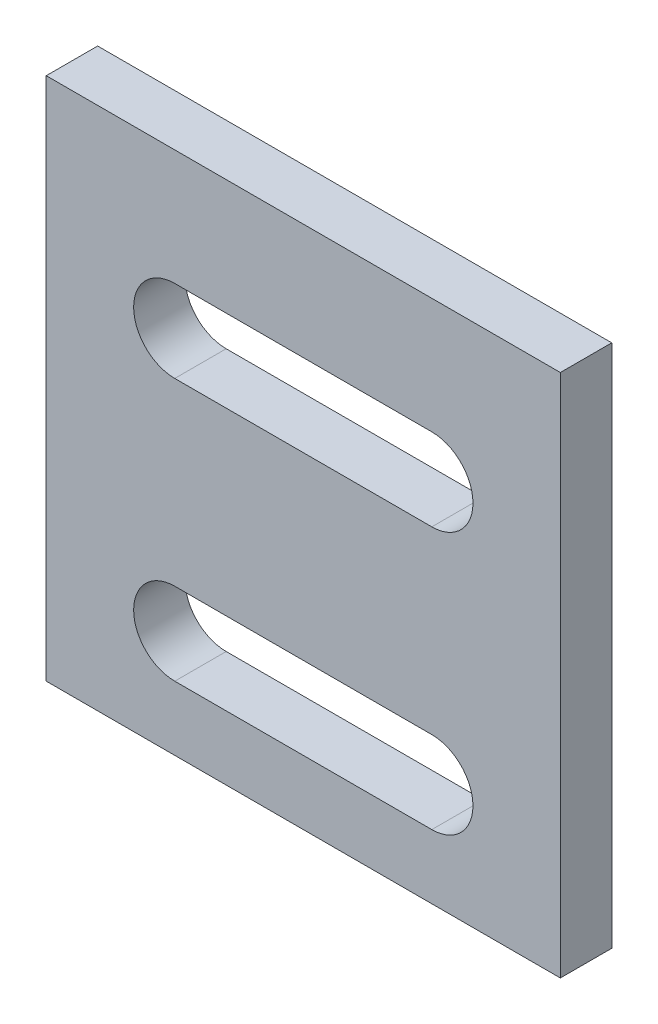
ISO-10303-21;
HEADER;
FILE_DESCRIPTION(('STEP AP214'),'2;1');
FILE_NAME('part.step','',(''),(''),'','','');
FILE_SCHEMA(('AUTOMOTIVE_DESIGN { 1 0 10303 214 1 1 1 1 }'));
ENDSEC;
DATA;
#1=APPLICATION_CONTEXT('core data for automotive mechanical design processes');
#2=APPLICATION_PROTOCOL_DEFINITION('international standard','automotive_design',2000,#1);
#3=PRODUCT_CONTEXT('',#1,'mechanical');
#4=PRODUCT('Part','Part','',(#3));
#5=PRODUCT_RELATED_PRODUCT_CATEGORY('part','',(#4));
#6=PRODUCT_DEFINITION_FORMATION('','',#4);
#7=PRODUCT_DEFINITION_CONTEXT('part definition',#1,'design');
#8=PRODUCT_DEFINITION('design','',#6,#7);
#9=PRODUCT_DEFINITION_SHAPE('','',#8);
#10=(LENGTH_UNIT() NAMED_UNIT(*) SI_UNIT(.MILLI.,.METRE.));
#11=(NAMED_UNIT(*) PLANE_ANGLE_UNIT() SI_UNIT($,.RADIAN.));
#12=(NAMED_UNIT(*) SI_UNIT($,.STERADIAN.) SOLID_ANGLE_UNIT());
#13=UNCERTAINTY_MEASURE_WITH_UNIT(LENGTH_MEASURE(1.E-05),#10,'distance_accuracy_value','');
#14=(GEOMETRIC_REPRESENTATION_CONTEXT(3) GLOBAL_UNCERTAINTY_ASSIGNED_CONTEXT((#13)) GLOBAL_UNIT_ASSIGNED_CONTEXT((#10,
#11,#12)) REPRESENTATION_CONTEXT('',''));
#15=CARTESIAN_POINT('',(0.,0.,0.));
#16=DIRECTION('',(0.,0.,1.));
#17=DIRECTION('',(1.,0.,0.));
#18=AXIS2_PLACEMENT_3D('',#15,#16,#17);
#19=CARTESIAN_POINT('',(0.,0.,2.));
#20=DIRECTION('',(0.,0.,1.));
#21=DIRECTION('',(1.,0.,0.));
#22=AXIS2_PLACEMENT_3D('',#19,#20,#21);
#23=PLANE('',#22);
#24=DIRECTION('',(0.,-1.,0.));
#25=VECTOR('',#24,1.);
#26=CARTESIAN_POINT('',(-18.1755180011164,18.0397420254147,2.));
#27=LINE('',#26,#25);
#28=CARTESIAN_POINT('',(-18.1755180011164,18.0397420254147,2.));
#29=VERTEX_POINT('',#28);
#30=CARTESIAN_POINT('',(-18.1755180011164,-2.36025797458528,2.));
#31=VERTEX_POINT('',#30);
#32=EDGE_CURVE('E224',#29,#31,#27,.T.);
#33=ORIENTED_EDGE('',*,*,#32,.T.);
#34=DIRECTION('',(1.,0.,0.));
#35=VECTOR('',#34,1.);
#36=CARTESIAN_POINT('',(-18.1755180011164,-2.36025797458528,2.));
#37=LINE('',#36,#35);
#38=CARTESIAN_POINT('',(1.82448199888361,-2.36025797458527,2.));
#39=VERTEX_POINT('',#38);
#40=EDGE_CURVE('E228',#31,#39,#37,.T.);
#41=ORIENTED_EDGE('',*,*,#40,.T.);
#42=DIRECTION('',(0.,1.,0.));
#43=VECTOR('',#42,1.);
#44=CARTESIAN_POINT('',(1.82448199888361,18.0397420254147,2.));
#45=LINE('',#44,#43);
#46=CARTESIAN_POINT('',(1.82448199888361,18.0397420254147,2.));
#47=VERTEX_POINT('',#46);
#48=EDGE_CURVE('E232',#39,#47,#45,.T.);
#49=ORIENTED_EDGE('',*,*,#48,.T.);
#50=DIRECTION('',(-1.,0.,0.));
#51=VECTOR('',#50,1.);
#52=CARTESIAN_POINT('',(-18.1755180011164,18.0397420254147,2.));
#53=LINE('',#52,#51);
#54=EDGE_CURVE('E235',#47,#29,#53,.T.);
#55=ORIENTED_EDGE('',*,*,#54,.T.);
#56=EDGE_LOOP('',(#33,#41,#49,#55));
#57=FACE_BOUND('',#56,.T.);
#58=DIRECTION('',(1.,0.,0.));
#59=VECTOR('',#58,1.);
#60=CARTESIAN_POINT('',(-13.1755180011164,10.3397420254147,2.));
#61=LINE('',#60,#59);
#62=CARTESIAN_POINT('',(-13.1755180011164,10.3397420254147,2.));
#63=VERTEX_POINT('',#62);
#64=CARTESIAN_POINT('',(-3.17551800111639,10.3397420254147,2.));
#65=VERTEX_POINT('',#64);
#66=EDGE_CURVE('E184',#63,#65,#61,.T.);
#67=ORIENTED_EDGE('',*,*,#66,.F.);
#68=CARTESIAN_POINT('',(-13.1755180011164,11.9397420254147,2.));
#69=DIRECTION('',(0.,0.,1.));
#70=DIRECTION('',(1.,0.,0.));
#71=AXIS2_PLACEMENT_3D('',#68,#69,#70);
#72=CIRCLE('',#71,1.6);
#73=CARTESIAN_POINT('',(-13.1755180011164,13.5397420254147,2.));
#74=VERTEX_POINT('',#73);
#75=EDGE_CURVE('E181',#74,#63,#72,.T.);
#76=ORIENTED_EDGE('',*,*,#75,.F.);
#77=DIRECTION('',(-1.,0.,0.));
#78=VECTOR('',#77,1.);
#79=CARTESIAN_POINT('',(-13.1755180011164,13.5397420254147,2.));
#80=LINE('',#79,#78);
#81=CARTESIAN_POINT('',(-3.17551800111639,13.5397420254147,2.));
#82=VERTEX_POINT('',#81);
#83=EDGE_CURVE('E192',#82,#74,#80,.T.);
#84=ORIENTED_EDGE('',*,*,#83,.F.);
#85=CARTESIAN_POINT('',(-3.17551800111639,11.9397420254147,2.));
#86=DIRECTION('',(0.,0.,1.));
#87=DIRECTION('',(1.,0.,0.));
#88=AXIS2_PLACEMENT_3D('',#85,#86,#87);
#89=CIRCLE('',#88,1.6);
#90=EDGE_CURVE('E188',#65,#82,#89,.T.);
#91=ORIENTED_EDGE('',*,*,#90,.F.);
#92=EDGE_LOOP('',(#67,#76,#84,#91));
#93=FACE_BOUND('',#92,.T.);
#94=DIRECTION('',(1.,0.,0.));
#95=VECTOR('',#94,1.);
#96=CARTESIAN_POINT('',(-13.1755180011164,0.139742025414731,2.));
#97=LINE('',#96,#95);
#98=CARTESIAN_POINT('',(-13.1755180011164,0.139742025414731,2.));
#99=VERTEX_POINT('',#98);
#100=CARTESIAN_POINT('',(-3.17551800111639,0.139742025414732,2.));
#101=VERTEX_POINT('',#100);
#102=EDGE_CURVE('E142',#99,#101,#97,.T.);
#103=ORIENTED_EDGE('',*,*,#102,.F.);
#104=CARTESIAN_POINT('',(-13.1755180011164,1.73974202541472,2.));
#105=DIRECTION('',(0.,0.,1.));
#106=DIRECTION('',(-1.,0.,0.));
#107=AXIS2_PLACEMENT_3D('',#104,#105,#106);
#108=CIRCLE('',#107,1.59999999999999);
#109=CARTESIAN_POINT('',(-13.1755180011164,3.33974202541472,2.));
#110=VERTEX_POINT('',#109);
#111=EDGE_CURVE('E133',#110,#99,#108,.T.);
#112=ORIENTED_EDGE('',*,*,#111,.F.);
#113=DIRECTION('',(-1.,0.,0.));
#114=VECTOR('',#113,1.);
#115=CARTESIAN_POINT('',(-13.1755180011164,3.33974202541472,2.));
#116=LINE('',#115,#114);
#117=CARTESIAN_POINT('',(-3.17551800111639,3.33974202541472,2.));
#118=VERTEX_POINT('',#117);
#119=EDGE_CURVE('E159',#118,#110,#116,.T.);
#120=ORIENTED_EDGE('',*,*,#119,.F.);
#121=CARTESIAN_POINT('',(-3.17551800111639,1.73974202541473,2.));
#122=DIRECTION('',(0.,0.,1.));
#123=DIRECTION('',(-1.,0.,0.));
#124=AXIS2_PLACEMENT_3D('',#121,#122,#123);
#125=CIRCLE('',#124,1.59999999999999);
#126=EDGE_CURVE('E155',#101,#118,#125,.T.);
#127=ORIENTED_EDGE('',*,*,#126,.F.);
#128=EDGE_LOOP('',(#103,#112,#120,#127));
#129=FACE_BOUND('',#128,.T.);
#130=ADVANCED_FACE('F43',(#57,#93,#129),#23,.T.);
#131=CARTESIAN_POINT('',(0.,0.,0.));
#132=DIRECTION('',(0.,0.,1.));
#133=DIRECTION('',(1.,0.,0.));
#134=AXIS2_PLACEMENT_3D('',#131,#132,#133);
#135=PLANE('',#134);
#136=CARTESIAN_POINT('',(-13.1755180011164,11.9397420254147,0.));
#137=DIRECTION('',(0.,0.,1.));
#138=DIRECTION('',(1.,0.,0.));
#139=AXIS2_PLACEMENT_3D('',#136,#137,#138);
#140=CIRCLE('',#139,1.6);
#141=CARTESIAN_POINT('',(-13.1755180011164,13.5397420254147,0.));
#142=VERTEX_POINT('',#141);
#143=CARTESIAN_POINT('',(-13.1755180011164,10.3397420254147,0.));
#144=VERTEX_POINT('',#143);
#145=EDGE_CURVE('E151',#142,#144,#140,.T.);
#146=ORIENTED_EDGE('',*,*,#145,.T.);
#147=DIRECTION('',(1.,0.,0.));
#148=VECTOR('',#147,1.);
#149=CARTESIAN_POINT('',(-13.1755180011164,10.3397420254147,0.));
#150=LINE('',#149,#148);
#151=CARTESIAN_POINT('',(-3.17551800111639,10.3397420254147,0.));
#152=VERTEX_POINT('',#151);
#153=EDGE_CURVE('E199',#144,#152,#150,.T.);
#154=ORIENTED_EDGE('',*,*,#153,.T.);
#155=CARTESIAN_POINT('',(-3.17551800111639,11.9397420254147,0.));
#156=DIRECTION('',(0.,0.,1.));
#157=DIRECTION('',(1.,0.,0.));
#158=AXIS2_PLACEMENT_3D('',#155,#156,#157);
#159=CIRCLE('',#158,1.6);
#160=CARTESIAN_POINT('',(-3.17551800111639,13.5397420254147,0.));
#161=VERTEX_POINT('',#160);
#162=EDGE_CURVE('E203',#152,#161,#159,.T.);
#163=ORIENTED_EDGE('',*,*,#162,.T.);
#164=DIRECTION('',(-1.,0.,0.));
#165=VECTOR('',#164,1.);
#166=CARTESIAN_POINT('',(-13.1755180011164,13.5397420254147,0.));
#167=LINE('',#166,#165);
#168=EDGE_CURVE('E185',#161,#142,#167,.T.);
#169=ORIENTED_EDGE('',*,*,#168,.T.);
#170=EDGE_LOOP('',(#146,#154,#163,#169));
#171=FACE_BOUND('',#170,.T.);
#172=DIRECTION('',(0.,-1.,0.));
#173=VECTOR('',#172,1.);
#174=CARTESIAN_POINT('',(-18.1755180011164,18.0397420254147,0.));
#175=LINE('',#174,#173);
#176=CARTESIAN_POINT('',(-18.1755180011164,18.0397420254147,0.));
#177=VERTEX_POINT('',#176);
#178=CARTESIAN_POINT('',(-18.1755180011164,-2.36025797458528,0.));
#179=VERTEX_POINT('',#178);
#180=EDGE_CURVE('E223',#177,#179,#175,.T.);
#181=ORIENTED_EDGE('',*,*,#180,.F.);
#182=DIRECTION('',(-1.,0.,0.));
#183=VECTOR('',#182,1.);
#184=CARTESIAN_POINT('',(-18.1755180011164,18.0397420254147,0.));
#185=LINE('',#184,#183);
#186=CARTESIAN_POINT('',(1.82448199888361,18.0397420254147,0.));
#187=VERTEX_POINT('',#186);
#188=EDGE_CURVE('E229',#187,#177,#185,.T.);
#189=ORIENTED_EDGE('',*,*,#188,.F.);
#190=DIRECTION('',(0.,1.,0.));
#191=VECTOR('',#190,1.);
#192=CARTESIAN_POINT('',(1.82448199888361,18.0397420254147,0.));
#193=LINE('',#192,#191);
#194=CARTESIAN_POINT('',(1.82448199888361,-2.36025797458527,0.));
#195=VERTEX_POINT('',#194);
#196=EDGE_CURVE('E245',#195,#187,#193,.T.);
#197=ORIENTED_EDGE('',*,*,#196,.F.);
#198=DIRECTION('',(1.,0.,0.));
#199=VECTOR('',#198,1.);
#200=CARTESIAN_POINT('',(-18.1755180011164,-2.36025797458528,0.));
#201=LINE('',#200,#199);
#202=EDGE_CURVE('E242',#179,#195,#201,.T.);
#203=ORIENTED_EDGE('',*,*,#202,.F.);
#204=EDGE_LOOP('',(#181,#189,#197,#203));
#205=FACE_BOUND('',#204,.T.);
#206=CARTESIAN_POINT('',(-13.1755180011164,1.73974202541472,0.));
#207=DIRECTION('',(0.,0.,1.));
#208=DIRECTION('',(-1.,0.,0.));
#209=AXIS2_PLACEMENT_3D('',#206,#207,#208);
#210=CIRCLE('',#209,1.59999999999999);
#211=CARTESIAN_POINT('',(-13.1755180011164,3.33974202541472,0.));
#212=VERTEX_POINT('',#211);
#213=CARTESIAN_POINT('',(-13.1755180011164,0.139742025414731,0.));
#214=VERTEX_POINT('',#213);
#215=EDGE_CURVE('E67',#212,#214,#210,.T.);
#216=ORIENTED_EDGE('',*,*,#215,.T.);
#217=DIRECTION('',(1.,0.,0.));
#218=VECTOR('',#217,1.);
#219=CARTESIAN_POINT('',(-13.1755180011164,0.139742025414731,0.));
#220=LINE('',#219,#218);
#221=CARTESIAN_POINT('',(-3.17551800111639,0.139742025414732,0.));
#222=VERTEX_POINT('',#221);
#223=EDGE_CURVE('E149',#214,#222,#220,.T.);
#224=ORIENTED_EDGE('',*,*,#223,.T.);
#225=CARTESIAN_POINT('',(-3.17551800111639,1.73974202541473,0.));
#226=DIRECTION('',(0.,0.,1.));
#227=DIRECTION('',(-1.,0.,0.));
#228=AXIS2_PLACEMENT_3D('',#225,#226,#227);
#229=CIRCLE('',#228,1.59999999999999);
#230=CARTESIAN_POINT('',(-3.17551800111639,3.33974202541472,0.));
#231=VERTEX_POINT('',#230);
#232=EDGE_CURVE('E168',#222,#231,#229,.T.);
#233=ORIENTED_EDGE('',*,*,#232,.T.);
#234=DIRECTION('',(-1.,0.,0.));
#235=VECTOR('',#234,1.);
#236=CARTESIAN_POINT('',(-13.1755180011164,3.33974202541472,0.));
#237=LINE('',#236,#235);
#238=EDGE_CURVE('E143',#231,#212,#237,.T.);
#239=ORIENTED_EDGE('',*,*,#238,.T.);
#240=EDGE_LOOP('',(#216,#224,#233,#239));
#241=FACE_BOUND('',#240,.T.);
#242=ADVANCED_FACE('F268',(#171,#205,#241),#135,.F.);
#243=CARTESIAN_POINT('',(-18.1755180011164,18.0397420254147,2.));
#244=DIRECTION('',(1.,0.,0.));
#245=DIRECTION('',(0.,0.,-1.));
#246=AXIS2_PLACEMENT_3D('',#243,#244,#245);
#247=PLANE('',#246);
#248=ORIENTED_EDGE('',*,*,#180,.T.);
#249=DIRECTION('',(0.,0.,-1.));
#250=VECTOR('',#249,1.);
#251=CARTESIAN_POINT('',(-18.1755180011164,-2.36025797458528,2.));
#252=LINE('',#251,#250);
#253=EDGE_CURVE('E11',#31,#179,#252,.T.);
#254=ORIENTED_EDGE('',*,*,#253,.F.);
#255=ORIENTED_EDGE('',*,*,#32,.F.);
#256=DIRECTION('',(0.,0.,-1.));
#257=VECTOR('',#256,1.);
#258=CARTESIAN_POINT('',(-18.1755180011164,18.0397420254147,2.));
#259=LINE('',#258,#257);
#260=EDGE_CURVE('E238',#29,#177,#259,.T.);
#261=ORIENTED_EDGE('',*,*,#260,.T.);
#262=EDGE_LOOP('',(#248,#254,#255,#261));
#263=FACE_BOUND('',#262,.T.);
#264=ADVANCED_FACE('F45',(#263),#247,.F.);
#265=CARTESIAN_POINT('',(-18.1755180011164,-2.36025797458528,2.));
#266=DIRECTION('',(0.,1.,0.));
#267=DIRECTION('',(-1.,0.,0.));
#268=AXIS2_PLACEMENT_3D('',#265,#266,#267);
#269=PLANE('',#268);
#270=ORIENTED_EDGE('',*,*,#202,.T.);
#271=DIRECTION('',(0.,0.,-1.));
#272=VECTOR('',#271,1.);
#273=CARTESIAN_POINT('',(1.82448199888361,-2.36025797458527,2.));
#274=LINE('',#273,#272);
#275=EDGE_CURVE('E52',#39,#195,#274,.T.);
#276=ORIENTED_EDGE('',*,*,#275,.F.);
#277=ORIENTED_EDGE('',*,*,#40,.F.);
#278=ORIENTED_EDGE('',*,*,#253,.T.);
#279=EDGE_LOOP('',(#270,#276,#277,#278));
#280=FACE_BOUND('',#279,.T.);
#281=ADVANCED_FACE('F279',(#280),#269,.F.);
#282=CARTESIAN_POINT('',(1.82448199888361,18.0397420254147,2.));
#283=DIRECTION('',(-1.,0.,0.));
#284=DIRECTION('',(0.,0.,1.));
#285=AXIS2_PLACEMENT_3D('',#282,#283,#284);
#286=PLANE('',#285);
#287=ORIENTED_EDGE('',*,*,#196,.T.);
#288=DIRECTION('',(0.,0.,-1.));
#289=VECTOR('',#288,1.);
#290=CARTESIAN_POINT('',(1.82448199888361,18.0397420254147,2.));
#291=LINE('',#290,#289);
#292=EDGE_CURVE('E253',#47,#187,#291,.T.);
#293=ORIENTED_EDGE('',*,*,#292,.F.);
#294=ORIENTED_EDGE('',*,*,#48,.F.);
#295=ORIENTED_EDGE('',*,*,#275,.T.);
#296=EDGE_LOOP('',(#287,#293,#294,#295));
#297=FACE_BOUND('',#296,.T.);
#298=ADVANCED_FACE('F262',(#297),#286,.F.);
#299=CARTESIAN_POINT('',(-18.1755180011164,18.0397420254147,2.));
#300=DIRECTION('',(0.,-1.,0.));
#301=DIRECTION('',(1.,0.,0.));
#302=AXIS2_PLACEMENT_3D('',#299,#300,#301);
#303=PLANE('',#302);
#304=ORIENTED_EDGE('',*,*,#188,.T.);
#305=ORIENTED_EDGE('',*,*,#260,.F.);
#306=ORIENTED_EDGE('',*,*,#54,.F.);
#307=ORIENTED_EDGE('',*,*,#292,.T.);
#308=EDGE_LOOP('',(#304,#305,#306,#307));
#309=FACE_BOUND('',#308,.T.);
#310=ADVANCED_FACE('F272',(#309),#303,.F.);
#311=CARTESIAN_POINT('',(-13.1755180011164,11.9397420254147,2.));
#312=DIRECTION('',(0.,0.,-1.));
#313=DIRECTION('',(-1.,0.,0.));
#314=AXIS2_PLACEMENT_3D('',#311,#312,#313);
#315=CYLINDRICAL_SURFACE('',#314,1.6);
#316=ORIENTED_EDGE('',*,*,#145,.F.);
#317=DIRECTION('',(0.,0.,-1.));
#318=VECTOR('',#317,1.);
#319=CARTESIAN_POINT('',(-13.1755180011164,13.5397420254147,2.));
#320=LINE('',#319,#318);
#321=EDGE_CURVE('E195',#74,#142,#320,.T.);
#322=ORIENTED_EDGE('',*,*,#321,.F.);
#323=ORIENTED_EDGE('',*,*,#75,.T.);
#324=DIRECTION('',(0.,0.,-1.));
#325=VECTOR('',#324,1.);
#326=CARTESIAN_POINT('',(-13.1755180011164,10.3397420254147,2.));
#327=LINE('',#326,#325);
#328=EDGE_CURVE('E219',#63,#144,#327,.T.);
#329=ORIENTED_EDGE('',*,*,#328,.T.);
#330=EDGE_LOOP('',(#316,#322,#323,#329));
#331=FACE_BOUND('',#330,.T.);
#332=ADVANCED_FACE('F294',(#331),#315,.F.);
#333=CARTESIAN_POINT('',(-13.1755180011164,10.3397420254147,2.));
#334=DIRECTION('',(0.,1.,0.));
#335=DIRECTION('',(-1.,0.,0.));
#336=AXIS2_PLACEMENT_3D('',#333,#334,#335);
#337=PLANE('',#336);
#338=ORIENTED_EDGE('',*,*,#153,.F.);
#339=ORIENTED_EDGE('',*,*,#328,.F.);
#340=ORIENTED_EDGE('',*,*,#66,.T.);
#341=DIRECTION('',(0.,0.,-1.));
#342=VECTOR('',#341,1.);
#343=CARTESIAN_POINT('',(-3.17551800111639,10.3397420254147,2.));
#344=LINE('',#343,#342);
#345=EDGE_CURVE('E216',#65,#152,#344,.T.);
#346=ORIENTED_EDGE('',*,*,#345,.T.);
#347=EDGE_LOOP('',(#338,#339,#340,#346));
#348=FACE_BOUND('',#347,.T.);
#349=ADVANCED_FACE('F301',(#348),#337,.T.);
#350=CARTESIAN_POINT('',(-3.17551800111639,11.9397420254147,2.));
#351=DIRECTION('',(0.,0.,-1.));
#352=DIRECTION('',(-1.,0.,0.));
#353=AXIS2_PLACEMENT_3D('',#350,#351,#352);
#354=CYLINDRICAL_SURFACE('',#353,1.6);
#355=ORIENTED_EDGE('',*,*,#162,.F.);
#356=ORIENTED_EDGE('',*,*,#345,.F.);
#357=ORIENTED_EDGE('',*,*,#90,.T.);
#358=DIRECTION('',(0.,0.,-1.));
#359=VECTOR('',#358,1.);
#360=CARTESIAN_POINT('',(-3.17551800111639,13.5397420254147,2.));
#361=LINE('',#360,#359);
#362=EDGE_CURVE('E213',#82,#161,#361,.T.);
#363=ORIENTED_EDGE('',*,*,#362,.T.);
#364=EDGE_LOOP('',(#355,#356,#357,#363));
#365=FACE_BOUND('',#364,.T.);
#366=ADVANCED_FACE('F306',(#365),#354,.F.);
#367=CARTESIAN_POINT('',(-13.1755180011164,13.5397420254147,2.));
#368=DIRECTION('',(0.,-1.,0.));
#369=DIRECTION('',(1.,0.,0.));
#370=AXIS2_PLACEMENT_3D('',#367,#368,#369);
#371=PLANE('',#370);
#372=ORIENTED_EDGE('',*,*,#168,.F.);
#373=ORIENTED_EDGE('',*,*,#362,.F.);
#374=ORIENTED_EDGE('',*,*,#83,.T.);
#375=ORIENTED_EDGE('',*,*,#321,.T.);
#376=EDGE_LOOP('',(#372,#373,#374,#375));
#377=FACE_BOUND('',#376,.T.);
#378=ADVANCED_FACE('F313',(#377),#371,.T.);
#379=CARTESIAN_POINT('',(-13.1755180011164,1.73974202541472,2.));
#380=DIRECTION('',(0.,0.,-1.));
#381=DIRECTION('',(-1.,0.,0.));
#382=AXIS2_PLACEMENT_3D('',#379,#380,#381);
#383=CYLINDRICAL_SURFACE('',#382,1.59999999999999);
#384=ORIENTED_EDGE('',*,*,#215,.F.);
#385=DIRECTION('',(0.,0.,-1.));
#386=VECTOR('',#385,1.);
#387=CARTESIAN_POINT('',(-13.1755180011164,3.33974202541472,2.));
#388=LINE('',#387,#386);
#389=EDGE_CURVE('E137',#110,#212,#388,.T.);
#390=ORIENTED_EDGE('',*,*,#389,.F.);
#391=ORIENTED_EDGE('',*,*,#111,.T.);
#392=DIRECTION('',(0.,0.,-1.));
#393=VECTOR('',#392,1.);
#394=CARTESIAN_POINT('',(-13.1755180011164,0.139742025414731,2.));
#395=LINE('',#394,#393);
#396=EDGE_CURVE('E136',#99,#214,#395,.T.);
#397=ORIENTED_EDGE('',*,*,#396,.T.);
#398=EDGE_LOOP('',(#384,#390,#391,#397));
#399=FACE_BOUND('',#398,.T.);
#400=ADVANCED_FACE('F135',(#399),#383,.F.);
#401=CARTESIAN_POINT('',(-13.1755180011164,0.139742025414731,2.));
#402=DIRECTION('',(0.,1.,0.));
#403=DIRECTION('',(-1.,0.,0.));
#404=AXIS2_PLACEMENT_3D('',#401,#402,#403);
#405=PLANE('',#404);
#406=ORIENTED_EDGE('',*,*,#223,.F.);
#407=ORIENTED_EDGE('',*,*,#396,.F.);
#408=ORIENTED_EDGE('',*,*,#102,.T.);
#409=DIRECTION('',(0.,0.,-1.));
#410=VECTOR('',#409,1.);
#411=CARTESIAN_POINT('',(-3.17551800111639,0.139742025414732,2.));
#412=LINE('',#411,#410);
#413=EDGE_CURVE('E152',#101,#222,#412,.T.);
#414=ORIENTED_EDGE('',*,*,#413,.T.);
#415=EDGE_LOOP('',(#406,#407,#408,#414));
#416=FACE_BOUND('',#415,.T.);
#417=ADVANCED_FACE('F146',(#416),#405,.T.);
#418=CARTESIAN_POINT('',(-3.17551800111639,1.73974202541473,2.));
#419=DIRECTION('',(0.,0.,-1.));
#420=DIRECTION('',(-1.,0.,0.));
#421=AXIS2_PLACEMENT_3D('',#418,#419,#420);
#422=CYLINDRICAL_SURFACE('',#421,1.59999999999999);
#423=ORIENTED_EDGE('',*,*,#232,.F.);
#424=ORIENTED_EDGE('',*,*,#413,.F.);
#425=ORIENTED_EDGE('',*,*,#126,.T.);
#426=DIRECTION('',(0.,0.,-1.));
#427=VECTOR('',#426,1.);
#428=CARTESIAN_POINT('',(-3.17551800111639,3.33974202541472,2.));
#429=LINE('',#428,#427);
#430=EDGE_CURVE('E59',#118,#231,#429,.T.);
#431=ORIENTED_EDGE('',*,*,#430,.T.);
#432=EDGE_LOOP('',(#423,#424,#425,#431));
#433=FACE_BOUND('',#432,.T.);
#434=ADVANCED_FACE('F331',(#433),#422,.F.);
#435=CARTESIAN_POINT('',(-13.1755180011164,3.33974202541472,2.));
#436=DIRECTION('',(0.,-1.,0.));
#437=DIRECTION('',(1.,0.,0.));
#438=AXIS2_PLACEMENT_3D('',#435,#436,#437);
#439=PLANE('',#438);
#440=ORIENTED_EDGE('',*,*,#238,.F.);
#441=ORIENTED_EDGE('',*,*,#430,.F.);
#442=ORIENTED_EDGE('',*,*,#119,.T.);
#443=ORIENTED_EDGE('',*,*,#389,.T.);
#444=EDGE_LOOP('',(#440,#441,#442,#443));
#445=FACE_BOUND('',#444,.T.);
#446=ADVANCED_FACE('F334',(#445),#439,.T.);
#447=CLOSED_SHELL('',(#130,#242,#264,#281,#298,#310,#332,#349,#366,#378,#400,#417,#434,#446));
#448=MANIFOLD_SOLID_BREP('B2',#447);
#449=ADVANCED_BREP_SHAPE_REPRESENTATION('',(#18,#448),#14);
#450=SHAPE_DEFINITION_REPRESENTATION(#9,#449);
ENDSEC;
END-ISO-10303-21;
